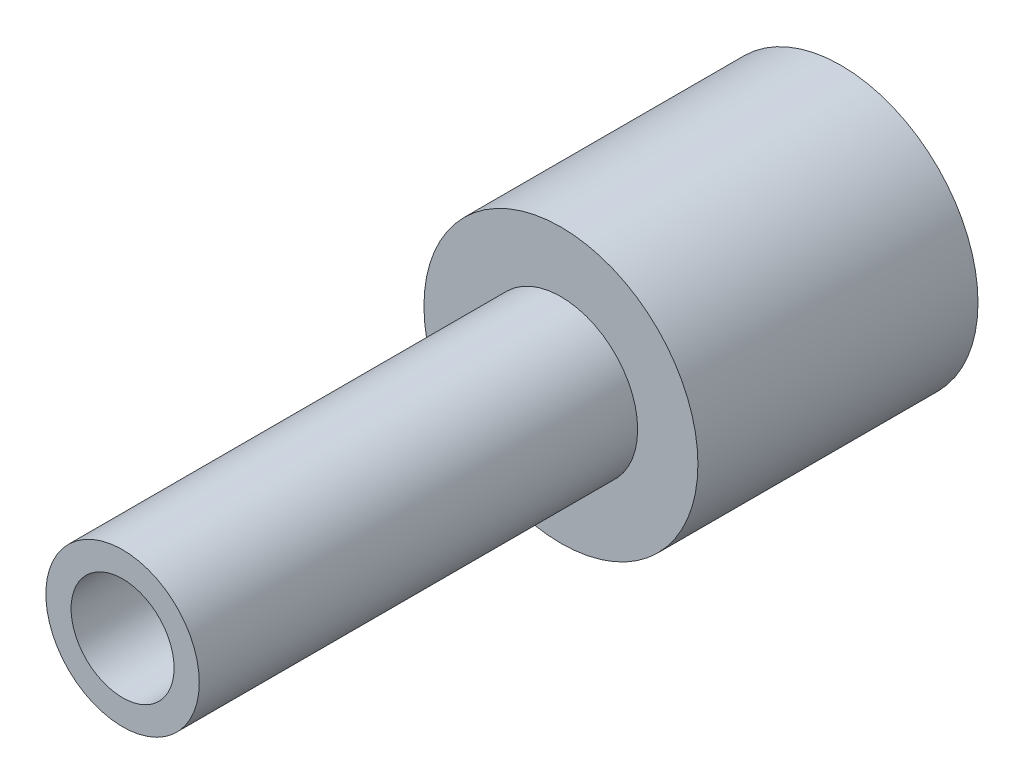
ISO-10303-21;
HEADER;
FILE_DESCRIPTION(('STEP AP214'),'2;1');
FILE_NAME('part.step','',(''),(''),'','','');
FILE_SCHEMA(('AUTOMOTIVE_DESIGN { 1 0 10303 214 1 1 1 1 }'));
ENDSEC;
DATA;
#1=APPLICATION_CONTEXT('core data for automotive mechanical design processes');
#2=APPLICATION_PROTOCOL_DEFINITION('international standard','automotive_design',2000,#1);
#3=PRODUCT_CONTEXT('',#1,'mechanical');
#4=PRODUCT('Part','Part','',(#3));
#5=PRODUCT_RELATED_PRODUCT_CATEGORY('part','',(#4));
#6=PRODUCT_DEFINITION_FORMATION('','',#4);
#7=PRODUCT_DEFINITION_CONTEXT('part definition',#1,'design');
#8=PRODUCT_DEFINITION('design','',#6,#7);
#9=PRODUCT_DEFINITION_SHAPE('','',#8);
#10=(LENGTH_UNIT() NAMED_UNIT(*) SI_UNIT(.MILLI.,.METRE.));
#11=(NAMED_UNIT(*) PLANE_ANGLE_UNIT() SI_UNIT($,.RADIAN.));
#12=(NAMED_UNIT(*) SI_UNIT($,.STERADIAN.) SOLID_ANGLE_UNIT());
#13=UNCERTAINTY_MEASURE_WITH_UNIT(LENGTH_MEASURE(1.E-05),#10,'distance_accuracy_value','');
#14=(GEOMETRIC_REPRESENTATION_CONTEXT(3) GLOBAL_UNCERTAINTY_ASSIGNED_CONTEXT((#13)) GLOBAL_UNIT_ASSIGNED_CONTEXT((#10,
#11,#12)) REPRESENTATION_CONTEXT('',''));
#15=CARTESIAN_POINT('',(0.,0.,0.));
#16=DIRECTION('',(0.,0.,1.));
#17=DIRECTION('',(1.,0.,0.));
#18=AXIS2_PLACEMENT_3D('',#15,#16,#17);
#19=CARTESIAN_POINT('',(0.,0.,17.526));
#20=DIRECTION('',(0.,0.,-1.));
#21=DIRECTION('',(-1.,0.,0.));
#22=AXIS2_PLACEMENT_3D('',#19,#20,#21);
#23=CYLINDRICAL_SURFACE('',#22,3.175);
#24=CARTESIAN_POINT('',(0.,0.,0.874592137755755));
#25=DIRECTION('',(0.,0.,1.));
#26=DIRECTION('',(1.,0.,0.));
#27=AXIS2_PLACEMENT_3D('',#24,#25,#26);
#28=CIRCLE('',#27,3.175);
#29=CARTESIAN_POINT('',(3.175,0.,0.874592137755755));
#30=VERTEX_POINT('',#29);
#31=EDGE_CURVE('E11',#30,#30,#28,.T.);
#32=ORIENTED_EDGE('',*,*,#31,.T.);
#33=EDGE_LOOP('',(#32));
#34=FACE_BOUND('',#33,.T.);
#35=CARTESIAN_POINT('',(0.,0.,7.366));
#36=DIRECTION('',(0.,0.,1.));
#37=DIRECTION('',(1.,0.,0.));
#38=AXIS2_PLACEMENT_3D('',#35,#36,#37);
#39=CIRCLE('',#38,3.175);
#40=CARTESIAN_POINT('',(3.175,0.,7.366));
#41=VERTEX_POINT('',#40);
#42=EDGE_CURVE('E42',#41,#41,#39,.T.);
#43=ORIENTED_EDGE('',*,*,#42,.F.);
#44=EDGE_LOOP('',(#43));
#45=FACE_BOUND('',#44,.T.);
#46=ADVANCED_FACE('F35',(#34,#45),#23,.T.);
#47=CARTESIAN_POINT('',(0.,0.,7.366));
#48=DIRECTION('',(0.,0.,1.));
#49=DIRECTION('',(1.,0.,0.));
#50=AXIS2_PLACEMENT_3D('',#47,#48,#49);
#51=PLANE('',#50);
#52=CARTESIAN_POINT('',(0.,0.,7.366));
#53=DIRECTION('',(0.,0.,1.));
#54=DIRECTION('',(1.,0.,0.));
#55=AXIS2_PLACEMENT_3D('',#52,#53,#54);
#56=CIRCLE('',#55,1.778);
#57=CARTESIAN_POINT('',(1.778,0.,7.366));
#58=VERTEX_POINT('',#57);
#59=EDGE_CURVE('E46',#58,#58,#56,.T.);
#60=ORIENTED_EDGE('',*,*,#59,.F.);
#61=EDGE_LOOP('',(#60));
#62=FACE_BOUND('',#61,.T.);
#63=ORIENTED_EDGE('',*,*,#42,.T.);
#64=EDGE_LOOP('',(#63));
#65=FACE_BOUND('',#64,.T.);
#66=ADVANCED_FACE('F78',(#62,#65),#51,.T.);
#67=CARTESIAN_POINT('',(0.,0.,7.366));
#68=DIRECTION('',(0.,0.,1.));
#69=DIRECTION('',(1.,0.,0.));
#70=AXIS2_PLACEMENT_3D('',#67,#68,#69);
#71=CYLINDRICAL_SURFACE('',#70,1.778);
#72=ORIENTED_EDGE('',*,*,#59,.T.);
#73=EDGE_LOOP('',(#72));
#74=FACE_BOUND('',#73,.T.);
#75=CARTESIAN_POINT('',(0.,0.,17.526));
#76=DIRECTION('',(0.,0.,1.));
#77=DIRECTION('',(1.,0.,0.));
#78=AXIS2_PLACEMENT_3D('',#75,#76,#77);
#79=CIRCLE('',#78,1.778);
#80=CARTESIAN_POINT('',(1.778,0.,17.526));
#81=VERTEX_POINT('',#80);
#82=EDGE_CURVE('E51',#81,#81,#79,.T.);
#83=ORIENTED_EDGE('',*,*,#82,.F.);
#84=EDGE_LOOP('',(#83));
#85=FACE_BOUND('',#84,.T.);
#86=ADVANCED_FACE('F76',(#74,#85),#71,.T.);
#87=CARTESIAN_POINT('',(0.,0.,17.526));
#88=DIRECTION('',(0.,0.,1.));
#89=DIRECTION('',(1.,0.,0.));
#90=AXIS2_PLACEMENT_3D('',#87,#88,#89);
#91=PLANE('',#90);
#92=CARTESIAN_POINT('',(0.,0.,17.526));
#93=DIRECTION('',(0.,0.,1.));
#94=DIRECTION('',(1.,0.,0.));
#95=AXIS2_PLACEMENT_3D('',#92,#93,#94);
#96=CIRCLE('',#95,1.1938);
#97=CARTESIAN_POINT('',(1.1938,0.,17.526));
#98=VERTEX_POINT('',#97);
#99=EDGE_CURVE('E56',#98,#98,#96,.T.);
#100=ORIENTED_EDGE('',*,*,#99,.F.);
#101=EDGE_LOOP('',(#100));
#102=FACE_BOUND('',#101,.T.);
#103=ORIENTED_EDGE('',*,*,#82,.T.);
#104=EDGE_LOOP('',(#103));
#105=FACE_BOUND('',#104,.T.);
#106=ADVANCED_FACE('F74',(#102,#105),#91,.T.);
#107=CARTESIAN_POINT('',(0.,0.,7.366));
#108=DIRECTION('',(0.,0.,1.));
#109=DIRECTION('',(1.,0.,0.));
#110=AXIS2_PLACEMENT_3D('',#107,#108,#109);
#111=CYLINDRICAL_SURFACE('',#110,1.1938);
#112=CARTESIAN_POINT('',(0.,0.,7.366));
#113=DIRECTION('',(0.,0.,1.));
#114=DIRECTION('',(1.,0.,0.));
#115=AXIS2_PLACEMENT_3D('',#112,#113,#114);
#116=CIRCLE('',#115,1.1938);
#117=CARTESIAN_POINT('',(1.1938,0.,7.366));
#118=VERTEX_POINT('',#117);
#119=EDGE_CURVE('E61',#118,#118,#116,.T.);
#120=ORIENTED_EDGE('',*,*,#119,.F.);
#121=EDGE_LOOP('',(#120));
#122=FACE_BOUND('',#121,.T.);
#123=ORIENTED_EDGE('',*,*,#99,.T.);
#124=EDGE_LOOP('',(#123));
#125=FACE_BOUND('',#124,.T.);
#126=ADVANCED_FACE('F85',(#122,#125),#111,.F.);
#127=CARTESIAN_POINT('',(0.,0.,7.366));
#128=DIRECTION('',(0.,0.,1.));
#129=DIRECTION('',(1.,0.,0.));
#130=AXIS2_PLACEMENT_3D('',#127,#128,#129);
#131=PLANE('',#130);
#132=CARTESIAN_POINT('',(0.,0.,7.366));
#133=DIRECTION('',(0.,0.,1.));
#134=DIRECTION('',(1.,0.,0.));
#135=AXIS2_PLACEMENT_3D('',#132,#133,#134);
#136=CIRCLE('',#135,0.635);
#137=CARTESIAN_POINT('',(0.635,0.,7.366));
#138=VERTEX_POINT('',#137);
#139=EDGE_CURVE('E54',#138,#138,#136,.T.);
#140=ORIENTED_EDGE('',*,*,#139,.F.);
#141=EDGE_LOOP('',(#140));
#142=FACE_BOUND('',#141,.T.);
#143=ORIENTED_EDGE('',*,*,#119,.T.);
#144=EDGE_LOOP('',(#143));
#145=FACE_BOUND('',#144,.T.);
#146=ADVANCED_FACE('F120',(#142,#145),#131,.T.);
#147=CARTESIAN_POINT('',(0.,0.,7.62));
#148=DIRECTION('',(0.,0.,-1.));
#149=DIRECTION('',(-1.,0.,0.));
#150=AXIS2_PLACEMENT_3D('',#147,#148,#149);
#151=CYLINDRICAL_SURFACE('',#150,0.635);
#152=ORIENTED_EDGE('',*,*,#139,.T.);
#153=EDGE_LOOP('',(#152));
#154=FACE_BOUND('',#153,.T.);
#155=CARTESIAN_POINT('',(0.,0.,0.));
#156=DIRECTION('',(0.,0.,-1.));
#157=DIRECTION('',(-1.,0.,0.));
#158=AXIS2_PLACEMENT_3D('',#155,#156,#157);
#159=CIRCLE('',#158,0.635);
#160=CARTESIAN_POINT('',(0.634999999999969,0.,0.));
#161=VERTEX_POINT('',#160);
#162=EDGE_CURVE('E57',#161,#161,#159,.T.);
#163=ORIENTED_EDGE('',*,*,#162,.T.);
#164=EDGE_LOOP('',(#163));
#165=FACE_BOUND('',#164,.T.);
#166=ADVANCED_FACE('F128',(#154,#165),#151,.F.);
#167=CARTESIAN_POINT('',(0.,0.,0.874592137755755));
#168=DIRECTION('',(0.,0.,1.));
#169=DIRECTION('',(1.,0.,0.));
#170=AXIS2_PLACEMENT_3D('',#167,#168,#169);
#171=CONICAL_SURFACE('',#170,3.175,1.23918376891598);
#172=CARTESIAN_POINT('',(0.634999999999969,0.,0.));
#173=CARTESIAN_POINT('',(0.661458333333303,0.,0.00911033476828908));
#174=CARTESIAN_POINT('',(0.687916666666637,0.,0.0182206695365782));
#175=CARTESIAN_POINT('',(0.740833333333304,0.,0.0364413390731565));
#176=CARTESIAN_POINT('',(0.767291666666638,0.,0.0455516738414456));
#177=CARTESIAN_POINT('',(0.820208333333305,0.,0.0637723433780238));
#178=CARTESIAN_POINT('',(0.846666666666638,0.,0.0728826781463129));
#179=CARTESIAN_POINT('',(0.899583333333306,0.,0.0911033476828912));
#180=CARTESIAN_POINT('',(0.926041666666639,0.,0.10021368245118));
#181=CARTESIAN_POINT('',(0.978958333333307,0.,0.118434351987759));
#182=CARTESIAN_POINT('',(1.00541666666664,0.,0.127544686756048));
#183=CARTESIAN_POINT('',(1.05833333333331,0.,0.145765356292626));
#184=CARTESIAN_POINT('',(1.08479166666664,0.,0.154875691060915));
#185=CARTESIAN_POINT('',(1.13770833333331,0.,0.173096360597493));
#186=CARTESIAN_POINT('',(1.16416666666664,0.,0.182206695365782));
#187=CARTESIAN_POINT('',(1.21708333333331,0.,0.200427364902361));
#188=CARTESIAN_POINT('',(1.24354166666664,0.,0.20953769967065));
#189=CARTESIAN_POINT('',(1.29645833333331,0.,0.227758369207228));
#190=CARTESIAN_POINT('',(1.32291666666664,0.,0.236868703975517));
#191=CARTESIAN_POINT('',(1.37583333333331,0.,0.255089373512095));
#192=CARTESIAN_POINT('',(1.40229166666664,0.,0.264199708280384));
#193=CARTESIAN_POINT('',(1.45520833333331,0.,0.282420377816963));
#194=CARTESIAN_POINT('',(1.48166666666665,0.,0.291530712585252));
#195=CARTESIAN_POINT('',(1.53458333333331,0.,0.30975138212183));
#196=CARTESIAN_POINT('',(1.56104166666665,0.,0.318861716890119));
#197=CARTESIAN_POINT('',(1.61395833333331,0.,0.337082386426697));
#198=CARTESIAN_POINT('',(1.64041666666665,0.,0.346192721194986));
#199=CARTESIAN_POINT('',(1.69333333333332,0.,0.364413390731565));
#200=CARTESIAN_POINT('',(1.71979166666665,0.,0.373523725499854));
#201=CARTESIAN_POINT('',(1.77270833333332,0.,0.391744395036432));
#202=CARTESIAN_POINT('',(1.79916666666665,0.,0.400854729804721));
#203=CARTESIAN_POINT('',(1.85208333333332,0.,0.419075399341299));
#204=CARTESIAN_POINT('',(1.87854166666665,0.,0.428185734109588));
#205=CARTESIAN_POINT('',(1.93145833333332,0.,0.446406403646167));
#206=CARTESIAN_POINT('',(1.95791666666665,0.,0.455516738414456));
#207=CARTESIAN_POINT('',(2.01083333333332,0.,0.473737407951034));
#208=CARTESIAN_POINT('',(2.03729166666665,0.,0.482847742719323));
#209=CARTESIAN_POINT('',(2.09020833333332,0.,0.501068412255901));
#210=CARTESIAN_POINT('',(2.11666666666665,0.,0.510178747024191));
#211=CARTESIAN_POINT('',(2.16958333333332,0.,0.528399416560769));
#212=CARTESIAN_POINT('',(2.19604166666665,0.,0.537509751329058));
#213=CARTESIAN_POINT('',(2.24895833333332,0.,0.555730420865636));
#214=CARTESIAN_POINT('',(2.27541666666666,0.,0.564840755633925));
#215=CARTESIAN_POINT('',(2.32833333333332,0.,0.583061425170503));
#216=CARTESIAN_POINT('',(2.35479166666666,0.,0.592171759938793));
#217=CARTESIAN_POINT('',(2.40770833333332,0.,0.610392429475371));
#218=CARTESIAN_POINT('',(2.43416666666666,0.,0.61950276424366));
#219=CARTESIAN_POINT('',(2.48708333333333,0.,0.637723433780238));
#220=CARTESIAN_POINT('',(2.51354166666666,0.,0.646833768548527));
#221=CARTESIAN_POINT('',(2.56645833333333,0.,0.665054438085106));
#222=CARTESIAN_POINT('',(2.59291666666666,0.,0.674164772853395));
#223=CARTESIAN_POINT('',(2.64583333333333,0.,0.692385442389973));
#224=CARTESIAN_POINT('',(2.67229166666666,0.,0.701495777158262));
#225=CARTESIAN_POINT('',(2.72520833333333,0.,0.71971644669484));
#226=CARTESIAN_POINT('',(2.75166666666666,0.,0.728826781463129));
#227=CARTESIAN_POINT('',(2.80458333333333,0.,0.747047450999708));
#228=CARTESIAN_POINT('',(2.83104166666666,0.,0.756157785767997));
#229=CARTESIAN_POINT('',(2.88395833333333,0.,0.774378455304575));
#230=CARTESIAN_POINT('',(2.91041666666666,0.,0.783488790072864));
#231=CARTESIAN_POINT('',(2.96333333333333,0.,0.801709459609442));
#232=CARTESIAN_POINT('',(2.98979166666666,0.,0.810819794377731));
#233=CARTESIAN_POINT('',(3.04270833333333,0.,0.82904046391431));
#234=CARTESIAN_POINT('',(3.06916666666667,0.,0.838150798682599));
#235=CARTESIAN_POINT('',(3.12208333333333,0.,0.856371468219177));
#236=CARTESIAN_POINT('',(3.14854166666667,0.,0.865481802987466));
#237=CARTESIAN_POINT('',(3.175,0.,0.874592137755755));
#238=B_SPLINE_CURVE_WITH_KNOTS('',3,(#172,#173,#174,#175,#176,#177,#178,#179,#180,#181,#182,
#183,#184,#185,#186,#187,#188,#189,#190,#191,#192,#193,#194,#195,#196,#197,#198,#199,#200,#201,
#202,#203,#204,#205,#206,#207,#208,#209,#210,#211,#212,#213,#214,#215,#216,#217,#218,#219,#220,
#221,#222,#223,#224,#225,#226,#227,#228,#229,#230,#231,#232,#233,#234,#235,#236,#237),
.UNSPECIFIED.,.F.,.F.,(4,2,2,2,2,2,2,2,2,2,2,2,2,2,2,2,2,2,2,2,2,2,2,2,2,2,2,2,2,2,2,2,4),(0.,
0.0839486415691933,0.167897283138386,0.251845924707579,0.335794566276772,0.419743207845965,
0.503691849415158,0.587640490984351,0.671589132553544,0.755537774122737,0.83948641569193,
0.923435057261123,1.00738369883032,1.09133234039951,1.1752809819687,1.25922962353789,
1.34317826510709,1.42712690667628,1.51107554824547,1.59502418981467,1.67897283138386,
1.76292147295305,1.84687011452225,1.93081875609144,2.01476739766063,2.09871603922982,
2.18266468079902,2.26661332236821,2.3505619639374,2.4345106055066,2.51845924707579,
2.60240788864498,2.68635653021418),.UNSPECIFIED.);
#239=EDGE_CURVE('BSEAM37',#161,#30,#238,.T.);
#240=ORIENTED_EDGE('',*,*,#162,.F.);
#241=ORIENTED_EDGE('',*,*,#31,.F.);
#242=ORIENTED_EDGE('',*,*,#239,.T.);
#243=ORIENTED_EDGE('',*,*,#239,.F.);
#244=EDGE_LOOP('',(#240,#242,#241,#243));
#245=FACE_BOUND('',#244,.T.);
#246=ADVANCED_FACE('F37',(#245),#171,.T.);
#247=CLOSED_SHELL('',(#46,#66,#86,#106,#126,#146,#166,#246));
#248=MANIFOLD_SOLID_BREP('B2',#247);
#249=ADVANCED_BREP_SHAPE_REPRESENTATION('',(#18,#248),#14);
#250=SHAPE_DEFINITION_REPRESENTATION(#9,#249);
ENDSEC;
END-ISO-10303-21;
